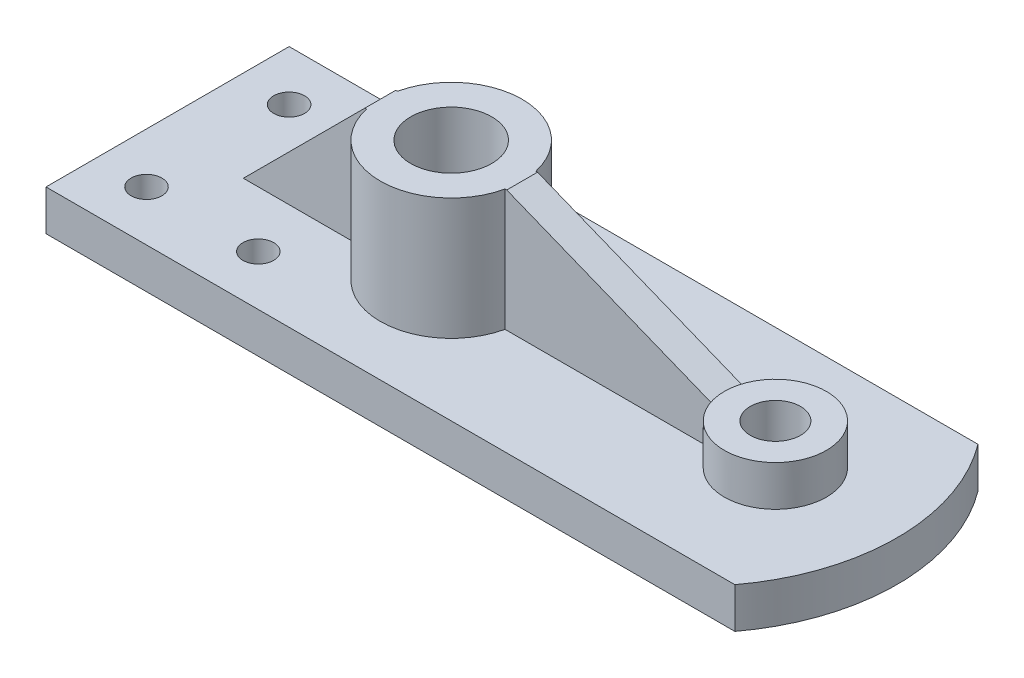
ISO-10303-21;
HEADER;
FILE_DESCRIPTION(('STEP AP214'),'2;1');
FILE_NAME('part.step','',(''),(''),'','','');
FILE_SCHEMA(('AUTOMOTIVE_DESIGN { 1 0 10303 214 1 1 1 1 }'));
ENDSEC;
DATA;
#1=APPLICATION_CONTEXT('core data for automotive mechanical design processes');
#2=APPLICATION_PROTOCOL_DEFINITION('international standard','automotive_design',2000,#1);
#3=PRODUCT_CONTEXT('',#1,'mechanical');
#4=PRODUCT('Part','Part','',(#3));
#5=PRODUCT_RELATED_PRODUCT_CATEGORY('part','',(#4));
#6=PRODUCT_DEFINITION_FORMATION('','',#4);
#7=PRODUCT_DEFINITION_CONTEXT('part definition',#1,'design');
#8=PRODUCT_DEFINITION('design','',#6,#7);
#9=PRODUCT_DEFINITION_SHAPE('','',#8);
#10=(LENGTH_UNIT() NAMED_UNIT(*) SI_UNIT(.MILLI.,.METRE.));
#11=(NAMED_UNIT(*) PLANE_ANGLE_UNIT() SI_UNIT($,.RADIAN.));
#12=(NAMED_UNIT(*) SI_UNIT($,.STERADIAN.) SOLID_ANGLE_UNIT());
#13=UNCERTAINTY_MEASURE_WITH_UNIT(LENGTH_MEASURE(1.E-05),#10,'distance_accuracy_value','');
#14=(GEOMETRIC_REPRESENTATION_CONTEXT(3) GLOBAL_UNCERTAINTY_ASSIGNED_CONTEXT((#13)) GLOBAL_UNIT_ASSIGNED_CONTEXT((#10,
#11,#12)) REPRESENTATION_CONTEXT('',''));
#15=CARTESIAN_POINT('',(0.,0.,0.));
#16=DIRECTION('',(0.,0.,1.));
#17=DIRECTION('',(1.,0.,0.));
#18=AXIS2_PLACEMENT_3D('',#15,#16,#17);
#19=CARTESIAN_POINT('',(88.9,25.4,0.));
#20=DIRECTION('',(0.,-1.,0.));
#21=DIRECTION('',(0.,0.,-1.));
#22=AXIS2_PLACEMENT_3D('',#19,#20,#21);
#23=CYLINDRICAL_SURFACE('',#22,22.225);
#24=DIRECTION('',(0.,-1.,0.));
#25=VECTOR('',#24,1.);
#26=CARTESIAN_POINT('',(110.594707856987,25.4,-4.826));
#27=LINE('',#26,#25);
#28=CARTESIAN_POINT('',(110.594707856987,12.7,-4.826));
#29=VERTEX_POINT('',#28);
#30=CARTESIAN_POINT('',(110.594707856987,50.8,-4.826));
#31=VERTEX_POINT('',#30);
#32=EDGE_CURVE('E180',#29,#31,#27,.F.);
#33=ORIENTED_EDGE('',*,*,#32,.F.);
#34=CARTESIAN_POINT('',(88.9,12.7,0.));
#35=DIRECTION('',(0.,1.,0.));
#36=DIRECTION('',(0.,0.,1.));
#37=AXIS2_PLACEMENT_3D('',#34,#35,#36);
#38=CIRCLE('',#37,22.225);
#39=CARTESIAN_POINT('',(67.2052921430133,12.7,-4.826));
#40=VERTEX_POINT('',#39);
#41=EDGE_CURVE('E230',#29,#40,#38,.T.);
#42=ORIENTED_EDGE('',*,*,#41,.T.);
#43=DIRECTION('',(0.,-1.,0.));
#44=VECTOR('',#43,1.);
#45=CARTESIAN_POINT('',(67.2052921430133,25.4,-4.826));
#46=LINE('',#45,#44);
#47=CARTESIAN_POINT('',(67.2052921430133,50.8,-4.826));
#48=VERTEX_POINT('',#47);
#49=EDGE_CURVE('E205',#48,#40,#46,.T.);
#50=ORIENTED_EDGE('',*,*,#49,.F.);
#51=CARTESIAN_POINT('',(88.9,50.8,0.));
#52=DIRECTION('',(0.,1.,0.));
#53=DIRECTION('',(0.,0.,1.));
#54=AXIS2_PLACEMENT_3D('',#51,#52,#53);
#55=CIRCLE('',#54,22.225);
#56=EDGE_CURVE('E221',#31,#48,#55,.T.);
#57=ORIENTED_EDGE('',*,*,#56,.F.);
#58=EDGE_LOOP('',(#33,#42,#50,#57));
#59=FACE_BOUND('',#58,.T.);
#60=ADVANCED_FACE('F55',(#59),#23,.T.);
#61=CARTESIAN_POINT('',(0.,12.7,0.));
#62=DIRECTION('',(0.,1.,0.));
#63=DIRECTION('',(0.,0.,1.));
#64=AXIS2_PLACEMENT_3D('',#61,#62,#63);
#65=PLANE('',#64);
#66=DIRECTION('',(1.,0.,0.));
#67=VECTOR('',#66,1.);
#68=CARTESIAN_POINT('',(0.,12.7,-4.826));
#69=LINE('',#68,#67);
#70=CARTESIAN_POINT('',(175.243076063636,12.7,-4.826));
#71=VERTEX_POINT('',#70);
#72=EDGE_CURVE('E177',#29,#71,#69,.T.);
#73=ORIENTED_EDGE('',*,*,#72,.T.);
#74=CARTESIAN_POINT('',(190.5,12.7,0.));
#75=DIRECTION('',(0.,1.,0.));
#76=DIRECTION('',(0.,0.,1.));
#77=AXIS2_PLACEMENT_3D('',#74,#75,#76);
#78=CIRCLE('',#77,16.002);
#79=CARTESIAN_POINT('',(175.243076063636,12.7,4.826));
#80=VERTEX_POINT('',#79);
#81=EDGE_CURVE('E226',#80,#71,#78,.T.);
#82=ORIENTED_EDGE('',*,*,#81,.F.);
#83=DIRECTION('',(1.,0.,0.));
#84=VECTOR('',#83,1.);
#85=CARTESIAN_POINT('',(0.,12.7,4.826));
#86=LINE('',#85,#84);
#87=CARTESIAN_POINT('',(110.594707856987,12.7,4.826));
#88=VERTEX_POINT('',#87);
#89=EDGE_CURVE('E184',#88,#80,#86,.T.);
#90=ORIENTED_EDGE('',*,*,#89,.F.);
#91=CARTESIAN_POINT('',(67.2052921430133,12.7,4.826));
#92=VERTEX_POINT('',#91);
#93=EDGE_CURVE('E232',#92,#88,#38,.T.);
#94=ORIENTED_EDGE('',*,*,#93,.F.);
#95=DIRECTION('',(1.,0.,0.));
#96=VECTOR('',#95,1.);
#97=CARTESIAN_POINT('',(0.,12.7,4.826));
#98=LINE('',#97,#96);
#99=CARTESIAN_POINT('',(28.5750000000002,12.7,4.826));
#100=VERTEX_POINT('',#99);
#101=EDGE_CURVE('E212',#100,#92,#98,.T.);
#102=ORIENTED_EDGE('',*,*,#101,.F.);
#103=DIRECTION('',(0.,0.,-1.));
#104=VECTOR('',#103,1.);
#105=CARTESIAN_POINT('',(28.5750000000002,12.7,0.));
#106=LINE('',#105,#104);
#107=CARTESIAN_POINT('',(28.5750000000002,12.7,-4.826));
#108=VERTEX_POINT('',#107);
#109=EDGE_CURVE('E215',#108,#100,#106,.F.);
#110=ORIENTED_EDGE('',*,*,#109,.F.);
#111=DIRECTION('',(1.,0.,0.));
#112=VECTOR('',#111,1.);
#113=CARTESIAN_POINT('',(0.,12.7,-4.826));
#114=LINE('',#113,#112);
#115=EDGE_CURVE('E206',#108,#40,#114,.T.);
#116=ORIENTED_EDGE('',*,*,#115,.T.);
#117=ORIENTED_EDGE('',*,*,#41,.F.);
#118=EDGE_LOOP('',(#73,#82,#90,#94,#102,#110,#116,#117));
#119=FACE_BOUND('',#118,.T.);
#120=DIRECTION('',(1.,0.,0.));
#121=VECTOR('',#120,1.);
#122=CARTESIAN_POINT('',(0.,12.7,-38.1));
#123=LINE('',#122,#121);
#124=CARTESIAN_POINT('',(0.,12.7,-38.1));
#125=VERTEX_POINT('',#124);
#126=CARTESIAN_POINT('',(215.9,12.7,-38.1));
#127=VERTEX_POINT('',#126);
#128=EDGE_CURVE('E245',#125,#127,#123,.T.);
#129=ORIENTED_EDGE('',*,*,#128,.F.);
#130=DIRECTION('',(0.,0.,-1.));
#131=VECTOR('',#130,1.);
#132=CARTESIAN_POINT('',(0.,12.7,0.));
#133=LINE('',#132,#131);
#134=CARTESIAN_POINT('',(0.,12.7,38.1));
#135=VERTEX_POINT('',#134);
#136=EDGE_CURVE('E248',#135,#125,#133,.T.);
#137=ORIENTED_EDGE('',*,*,#136,.F.);
#138=DIRECTION('',(1.,0.,0.));
#139=VECTOR('',#138,1.);
#140=CARTESIAN_POINT('',(0.,12.7,38.1));
#141=LINE('',#140,#139);
#142=CARTESIAN_POINT('',(215.9,12.7,38.1));
#143=VERTEX_POINT('',#142);
#144=EDGE_CURVE('E239',#135,#143,#141,.T.);
#145=ORIENTED_EDGE('',*,*,#144,.T.);
#146=CARTESIAN_POINT('',(165.1,12.7,0.));
#147=DIRECTION('',(0.,1.,0.));
#148=DIRECTION('',(0.,0.,1.));
#149=AXIS2_PLACEMENT_3D('',#146,#147,#148);
#150=CIRCLE('',#149,63.5);
#151=EDGE_CURVE('E243',#143,#127,#150,.T.);
#152=ORIENTED_EDGE('',*,*,#151,.T.);
#153=EDGE_LOOP('',(#129,#137,#145,#152));
#154=FACE_BOUND('',#153,.T.);
#155=CARTESIAN_POINT('',(50.8,12.7,22.352));
#156=DIRECTION('',(0.,1.,0.));
#157=DIRECTION('',(0.,0.,1.));
#158=AXIS2_PLACEMENT_3D('',#155,#156,#157);
#159=CIRCLE('',#158,4.826);
#160=CARTESIAN_POINT('',(50.8,12.7,27.178));
#161=VERTEX_POINT('',#160);
#162=EDGE_CURVE('E236',#161,#161,#159,.T.);
#163=ORIENTED_EDGE('',*,*,#162,.F.);
#164=EDGE_LOOP('',(#163));
#165=FACE_BOUND('',#164,.T.);
#166=CARTESIAN_POINT('',(15.748,12.7,-22.352));
#167=DIRECTION('',(0.,1.,0.));
#168=DIRECTION('',(0.,0.,1.));
#169=AXIS2_PLACEMENT_3D('',#166,#167,#168);
#170=CIRCLE('',#169,4.826);
#171=CARTESIAN_POINT('',(15.748,12.7,-17.526));
#172=VERTEX_POINT('',#171);
#173=EDGE_CURVE('E250',#172,#172,#170,.T.);
#174=ORIENTED_EDGE('',*,*,#173,.F.);
#175=EDGE_LOOP('',(#174));
#176=FACE_BOUND('',#175,.T.);
#177=CARTESIAN_POINT('',(15.748,12.7,22.352));
#178=DIRECTION('',(0.,1.,0.));
#179=DIRECTION('',(0.,0.,1.));
#180=AXIS2_PLACEMENT_3D('',#177,#178,#179);
#181=CIRCLE('',#180,4.826);
#182=CARTESIAN_POINT('',(15.748,12.7,27.178));
#183=VERTEX_POINT('',#182);
#184=EDGE_CURVE('E253',#183,#183,#181,.F.);
#185=ORIENTED_EDGE('',*,*,#184,.T.);
#186=EDGE_LOOP('',(#185));
#187=FACE_BOUND('',#186,.T.);
#188=ADVANCED_FACE('F300',(#119,#154,#165,#176,#187),#65,.T.);
#189=CARTESIAN_POINT('',(0.,12.7,38.1));
#190=DIRECTION('',(0.,0.,-1.));
#191=DIRECTION('',(-1.,0.,0.));
#192=AXIS2_PLACEMENT_3D('',#189,#190,#191);
#193=PLANE('',#192);
#194=DIRECTION('',(1.,0.,0.));
#195=VECTOR('',#194,1.);
#196=CARTESIAN_POINT('',(0.,0.,38.1));
#197=LINE('',#196,#195);
#198=CARTESIAN_POINT('',(0.,0.,38.1));
#199=VERTEX_POINT('',#198);
#200=CARTESIAN_POINT('',(215.9,0.,38.1));
#201=VERTEX_POINT('',#200);
#202=EDGE_CURVE('E262',#199,#201,#197,.T.);
#203=ORIENTED_EDGE('',*,*,#202,.T.);
#204=DIRECTION('',(0.,-1.,0.));
#205=VECTOR('',#204,1.);
#206=CARTESIAN_POINT('',(215.9,12.7,38.1));
#207=LINE('',#206,#205);
#208=EDGE_CURVE('E12',#143,#201,#207,.T.);
#209=ORIENTED_EDGE('',*,*,#208,.F.);
#210=ORIENTED_EDGE('',*,*,#144,.F.);
#211=DIRECTION('',(0.,-1.,0.));
#212=VECTOR('',#211,1.);
#213=CARTESIAN_POINT('',(0.,12.7,38.1));
#214=LINE('',#213,#212);
#215=EDGE_CURVE('E256',#135,#199,#214,.T.);
#216=ORIENTED_EDGE('',*,*,#215,.T.);
#217=EDGE_LOOP('',(#203,#209,#210,#216));
#218=FACE_BOUND('',#217,.T.);
#219=ADVANCED_FACE('F306',(#218),#193,.F.);
#220=CARTESIAN_POINT('',(165.1,12.7,0.));
#221=DIRECTION('',(0.,-1.,0.));
#222=DIRECTION('',(0.,0.,-1.));
#223=AXIS2_PLACEMENT_3D('',#220,#221,#222);
#224=CYLINDRICAL_SURFACE('',#223,63.5);
#225=CARTESIAN_POINT('',(165.1,0.,0.));
#226=DIRECTION('',(0.,1.,0.));
#227=DIRECTION('',(0.,0.,1.));
#228=AXIS2_PLACEMENT_3D('',#225,#226,#227);
#229=CIRCLE('',#228,63.5);
#230=CARTESIAN_POINT('',(215.9,0.,-38.1));
#231=VERTEX_POINT('',#230);
#232=EDGE_CURVE('E265',#201,#231,#229,.T.);
#233=ORIENTED_EDGE('',*,*,#232,.T.);
#234=DIRECTION('',(0.,-1.,0.));
#235=VECTOR('',#234,1.);
#236=CARTESIAN_POINT('',(215.9,12.7,-38.1));
#237=LINE('',#236,#235);
#238=EDGE_CURVE('E63',#127,#231,#237,.T.);
#239=ORIENTED_EDGE('',*,*,#238,.F.);
#240=ORIENTED_EDGE('',*,*,#151,.F.);
#241=ORIENTED_EDGE('',*,*,#208,.T.);
#242=EDGE_LOOP('',(#233,#239,#240,#241));
#243=FACE_BOUND('',#242,.T.);
#244=ADVANCED_FACE('F304',(#243),#224,.T.);
#245=CARTESIAN_POINT('',(0.,12.7,-38.1));
#246=DIRECTION('',(0.,0.,-1.));
#247=DIRECTION('',(-1.,0.,0.));
#248=AXIS2_PLACEMENT_3D('',#245,#246,#247);
#249=PLANE('',#248);
#250=DIRECTION('',(1.,0.,0.));
#251=VECTOR('',#250,1.);
#252=CARTESIAN_POINT('',(0.,0.,-38.1));
#253=LINE('',#252,#251);
#254=CARTESIAN_POINT('',(0.,0.,-38.1));
#255=VERTEX_POINT('',#254);
#256=EDGE_CURVE('E267',#255,#231,#253,.T.);
#257=ORIENTED_EDGE('',*,*,#256,.F.);
#258=DIRECTION('',(0.,-1.,0.));
#259=VECTOR('',#258,1.);
#260=CARTESIAN_POINT('',(0.,12.7,-38.1));
#261=LINE('',#260,#259);
#262=EDGE_CURVE('E281',#125,#255,#261,.T.);
#263=ORIENTED_EDGE('',*,*,#262,.F.);
#264=ORIENTED_EDGE('',*,*,#128,.T.);
#265=ORIENTED_EDGE('',*,*,#238,.T.);
#266=EDGE_LOOP('',(#257,#263,#264,#265));
#267=FACE_BOUND('',#266,.T.);
#268=ADVANCED_FACE('F287',(#267),#249,.T.);
#269=CARTESIAN_POINT('',(15.748,12.7,22.352));
#270=DIRECTION('',(0.,-1.,0.));
#271=DIRECTION('',(0.,0.,-1.));
#272=AXIS2_PLACEMENT_3D('',#269,#270,#271);
#273=CYLINDRICAL_SURFACE('',#272,4.826);
#274=ORIENTED_EDGE('',*,*,#184,.F.);
#275=EDGE_LOOP('',(#274));
#276=FACE_BOUND('',#275,.T.);
#277=CARTESIAN_POINT('',(15.748,0.,22.352));
#278=DIRECTION('',(0.,1.,0.));
#279=DIRECTION('',(0.,0.,1.));
#280=AXIS2_PLACEMENT_3D('',#277,#278,#279);
#281=CIRCLE('',#280,4.826);
#282=CARTESIAN_POINT('',(15.748,0.,27.178));
#283=VERTEX_POINT('',#282);
#284=EDGE_CURVE('E275',#283,#283,#281,.F.);
#285=ORIENTED_EDGE('',*,*,#284,.T.);
#286=EDGE_LOOP('',(#285));
#287=FACE_BOUND('',#286,.T.);
#288=ADVANCED_FACE('F541',(#276,#287),#273,.F.);
#289=CARTESIAN_POINT('',(15.748,12.7,-22.352));
#290=DIRECTION('',(0.,-1.,0.));
#291=DIRECTION('',(0.,0.,-1.));
#292=AXIS2_PLACEMENT_3D('',#289,#290,#291);
#293=CYLINDRICAL_SURFACE('',#292,4.826);
#294=ORIENTED_EDGE('',*,*,#173,.T.);
#295=EDGE_LOOP('',(#294));
#296=FACE_BOUND('',#295,.T.);
#297=CARTESIAN_POINT('',(15.748,0.,-22.352));
#298=DIRECTION('',(0.,1.,0.));
#299=DIRECTION('',(0.,0.,1.));
#300=AXIS2_PLACEMENT_3D('',#297,#298,#299);
#301=CIRCLE('',#300,4.826);
#302=CARTESIAN_POINT('',(15.748,0.,-17.526));
#303=VERTEX_POINT('',#302);
#304=EDGE_CURVE('E272',#303,#303,#301,.T.);
#305=ORIENTED_EDGE('',*,*,#304,.F.);
#306=EDGE_LOOP('',(#305));
#307=FACE_BOUND('',#306,.T.);
#308=ADVANCED_FACE('F440',(#296,#307),#293,.F.);
#309=CARTESIAN_POINT('',(0.,12.7,0.));
#310=DIRECTION('',(-1.,0.,0.));
#311=DIRECTION('',(0.,0.,1.));
#312=AXIS2_PLACEMENT_3D('',#309,#310,#311);
#313=PLANE('',#312);
#314=ORIENTED_EDGE('',*,*,#136,.T.);
#315=ORIENTED_EDGE('',*,*,#262,.T.);
#316=DIRECTION('',(0.,0.,-1.));
#317=VECTOR('',#316,1.);
#318=CARTESIAN_POINT('',(0.,0.,0.));
#319=LINE('',#318,#317);
#320=EDGE_CURVE('E270',#199,#255,#319,.T.);
#321=ORIENTED_EDGE('',*,*,#320,.F.);
#322=ORIENTED_EDGE('',*,*,#215,.F.);
#323=EDGE_LOOP('',(#314,#315,#321,#322));
#324=FACE_BOUND('',#323,.T.);
#325=ADVANCED_FACE('F297',(#324),#313,.T.);
#326=CARTESIAN_POINT('',(50.8,12.7,22.352));
#327=DIRECTION('',(0.,-1.,0.));
#328=DIRECTION('',(0.,0.,-1.));
#329=AXIS2_PLACEMENT_3D('',#326,#327,#328);
#330=CYLINDRICAL_SURFACE('',#329,4.826);
#331=ORIENTED_EDGE('',*,*,#162,.T.);
#332=EDGE_LOOP('',(#331));
#333=FACE_BOUND('',#332,.T.);
#334=CARTESIAN_POINT('',(50.8,0.,22.352));
#335=DIRECTION('',(0.,1.,0.));
#336=DIRECTION('',(0.,0.,1.));
#337=AXIS2_PLACEMENT_3D('',#334,#335,#336);
#338=CIRCLE('',#337,4.826);
#339=CARTESIAN_POINT('',(50.8,0.,27.178));
#340=VERTEX_POINT('',#339);
#341=EDGE_CURVE('E259',#340,#340,#338,.T.);
#342=ORIENTED_EDGE('',*,*,#341,.F.);
#343=EDGE_LOOP('',(#342));
#344=FACE_BOUND('',#343,.T.);
#345=ADVANCED_FACE('F439',(#333,#344),#330,.F.);
#346=CARTESIAN_POINT('',(88.9,12.7,0.));
#347=DIRECTION('',(0.,-1.,0.));
#348=DIRECTION('',(0.,0.,-1.));
#349=AXIS2_PLACEMENT_3D('',#346,#347,#348);
#350=CYLINDRICAL_SURFACE('',#349,12.7);
#351=CARTESIAN_POINT('',(88.9,0.,0.));
#352=DIRECTION('',(0.,1.,0.));
#353=DIRECTION('',(0.,0.,1.));
#354=AXIS2_PLACEMENT_3D('',#351,#352,#353);
#355=CIRCLE('',#354,12.7);
#356=CARTESIAN_POINT('',(88.9,0.,12.7));
#357=VERTEX_POINT('',#356);
#358=EDGE_CURVE('E235',#357,#357,#355,.T.);
#359=ORIENTED_EDGE('',*,*,#358,.F.);
#360=EDGE_LOOP('',(#359));
#361=FACE_BOUND('',#360,.T.);
#362=CARTESIAN_POINT('',(88.9,50.8,0.));
#363=DIRECTION('',(0.,1.,0.));
#364=DIRECTION('',(0.,0.,1.));
#365=AXIS2_PLACEMENT_3D('',#362,#363,#364);
#366=CIRCLE('',#365,12.7);
#367=CARTESIAN_POINT('',(88.9,50.8,12.7));
#368=VERTEX_POINT('',#367);
#369=EDGE_CURVE('E218',#368,#368,#366,.T.);
#370=ORIENTED_EDGE('',*,*,#369,.T.);
#371=EDGE_LOOP('',(#370));
#372=FACE_BOUND('',#371,.T.);
#373=ADVANCED_FACE('F57',(#361,#372),#350,.F.);
#374=CARTESIAN_POINT('',(190.5,12.7,0.));
#375=DIRECTION('',(0.,-1.,0.));
#376=DIRECTION('',(0.,0.,-1.));
#377=AXIS2_PLACEMENT_3D('',#374,#375,#376);
#378=CYLINDRICAL_SURFACE('',#377,7.874);
#379=CARTESIAN_POINT('',(190.5,0.,0.));
#380=DIRECTION('',(0.,1.,0.));
#381=DIRECTION('',(0.,0.,1.));
#382=AXIS2_PLACEMENT_3D('',#379,#380,#381);
#383=CIRCLE('',#382,7.874);
#384=CARTESIAN_POINT('',(190.5,0.,7.874));
#385=VERTEX_POINT('',#384);
#386=EDGE_CURVE('E240',#385,#385,#383,.T.);
#387=ORIENTED_EDGE('',*,*,#386,.F.);
#388=EDGE_LOOP('',(#387));
#389=FACE_BOUND('',#388,.T.);
#390=CARTESIAN_POINT('',(190.5,25.4,0.));
#391=DIRECTION('',(0.,1.,0.));
#392=DIRECTION('',(0.,0.,1.));
#393=AXIS2_PLACEMENT_3D('',#390,#391,#392);
#394=CIRCLE('',#393,7.874);
#395=CARTESIAN_POINT('',(190.5,25.4,7.874));
#396=VERTEX_POINT('',#395);
#397=EDGE_CURVE('E223',#396,#396,#394,.T.);
#398=ORIENTED_EDGE('',*,*,#397,.T.);
#399=EDGE_LOOP('',(#398));
#400=FACE_BOUND('',#399,.T.);
#401=ADVANCED_FACE('F333',(#389,#400),#378,.F.);
#402=CARTESIAN_POINT('',(0.,0.,0.));
#403=DIRECTION('',(0.,1.,0.));
#404=DIRECTION('',(0.,0.,1.));
#405=AXIS2_PLACEMENT_3D('',#402,#403,#404);
#406=PLANE('',#405);
#407=ORIENTED_EDGE('',*,*,#358,.T.);
#408=EDGE_LOOP('',(#407));
#409=FACE_BOUND('',#408,.T.);
#410=ORIENTED_EDGE('',*,*,#386,.T.);
#411=EDGE_LOOP('',(#410));
#412=FACE_BOUND('',#411,.T.);
#413=ORIENTED_EDGE('',*,*,#320,.T.);
#414=ORIENTED_EDGE('',*,*,#256,.T.);
#415=ORIENTED_EDGE('',*,*,#232,.F.);
#416=ORIENTED_EDGE('',*,*,#202,.F.);
#417=EDGE_LOOP('',(#413,#414,#415,#416));
#418=FACE_BOUND('',#417,.T.);
#419=ORIENTED_EDGE('',*,*,#341,.T.);
#420=EDGE_LOOP('',(#419));
#421=FACE_BOUND('',#420,.T.);
#422=ORIENTED_EDGE('',*,*,#284,.F.);
#423=EDGE_LOOP('',(#422));
#424=FACE_BOUND('',#423,.T.);
#425=ORIENTED_EDGE('',*,*,#304,.T.);
#426=EDGE_LOOP('',(#425));
#427=FACE_BOUND('',#426,.T.);
#428=ADVANCED_FACE('F292',(#409,#412,#418,#421,#424,#427),#406,.F.);
#429=ORIENTED_EDGE('',*,*,#93,.T.);
#430=DIRECTION('',(0.,-1.,0.));
#431=VECTOR('',#430,1.);
#432=CARTESIAN_POINT('',(110.594707856987,25.4,4.826));
#433=LINE('',#432,#431);
#434=CARTESIAN_POINT('',(110.594707856987,50.8,4.826));
#435=VERTEX_POINT('',#434);
#436=EDGE_CURVE('E186',#88,#435,#433,.F.);
#437=ORIENTED_EDGE('',*,*,#436,.T.);
#438=CARTESIAN_POINT('',(67.2052921430133,50.8,4.826));
#439=VERTEX_POINT('',#438);
#440=EDGE_CURVE('E78',#439,#435,#55,.T.);
#441=ORIENTED_EDGE('',*,*,#440,.F.);
#442=DIRECTION('',(0.,-1.,0.));
#443=VECTOR('',#442,1.);
#444=CARTESIAN_POINT('',(67.2052921430133,25.4,4.826));
#445=LINE('',#444,#443);
#446=EDGE_CURVE('E209',#439,#92,#445,.T.);
#447=ORIENTED_EDGE('',*,*,#446,.T.);
#448=EDGE_LOOP('',(#429,#437,#441,#447));
#449=FACE_BOUND('',#448,.T.);
#450=ADVANCED_FACE('F319',(#449),#23,.T.);
#451=CARTESIAN_POINT('',(190.5,25.4,0.));
#452=DIRECTION('',(0.,1.,0.));
#453=DIRECTION('',(0.,0.,1.));
#454=AXIS2_PLACEMENT_3D('',#451,#452,#453);
#455=PLANE('',#454);
#456=ORIENTED_EDGE('',*,*,#397,.F.);
#457=EDGE_LOOP('',(#456));
#458=FACE_BOUND('',#457,.T.);
#459=CARTESIAN_POINT('',(190.5,25.4,0.));
#460=DIRECTION('',(0.,1.,0.));
#461=DIRECTION('',(0.,0.,1.));
#462=AXIS2_PLACEMENT_3D('',#459,#460,#461);
#463=CIRCLE('',#462,16.002);
#464=CARTESIAN_POINT('',(174.498,25.4,0.));
#465=VERTEX_POINT('',#464);
#466=EDGE_CURVE('E227',#465,#465,#463,.T.);
#467=ORIENTED_EDGE('',*,*,#466,.T.);
#468=EDGE_LOOP('',(#467));
#469=FACE_BOUND('',#468,.T.);
#470=ADVANCED_FACE('F325',(#458,#469),#455,.T.);
#471=CARTESIAN_POINT('',(190.5,25.4,0.));
#472=DIRECTION('',(0.,-1.,0.));
#473=DIRECTION('',(0.,0.,-1.));
#474=AXIS2_PLACEMENT_3D('',#471,#472,#473);
#475=CYLINDRICAL_SURFACE('',#474,16.002);
#476=ORIENTED_EDGE('',*,*,#81,.T.);
#477=DIRECTION('',(0.,-1.,0.));
#478=VECTOR('',#477,1.);
#479=CARTESIAN_POINT('',(175.243076063636,25.4,-4.826));
#480=LINE('',#479,#478);
#481=CARTESIAN_POINT('',(175.243076063636,25.101372319184,-4.826));
#482=VERTEX_POINT('',#481);
#483=EDGE_CURVE('E163',#482,#71,#480,.T.);
#484=ORIENTED_EDGE('',*,*,#483,.F.);
#485=CARTESIAN_POINT('',(190.5,18.986372745491,0.));
#486=DIRECTION('',(-0.372032022248701,-0.92821989551051,0.));
#487=DIRECTION('',(0.92821989551051,-0.372032022248701,0.));
#488=AXIS2_PLACEMENT_3D('',#485,#486,#487);
#489=ELLIPSE('',#488,17.2394494854035,16.002);
#490=EDGE_CURVE('E190',#482,#465,#489,.F.);
#491=ORIENTED_EDGE('',*,*,#490,.T.);
#492=ORIENTED_EDGE('',*,*,#466,.F.);
#493=CARTESIAN_POINT('',(175.243076063636,25.101372319184,4.826));
#494=VERTEX_POINT('',#493);
#495=EDGE_CURVE('E189',#465,#494,#489,.F.);
#496=ORIENTED_EDGE('',*,*,#495,.T.);
#497=DIRECTION('',(0.,-1.,0.));
#498=VECTOR('',#497,1.);
#499=CARTESIAN_POINT('',(175.243076063636,25.4,4.826));
#500=LINE('',#499,#498);
#501=EDGE_CURVE('E172',#494,#80,#500,.T.);
#502=ORIENTED_EDGE('',*,*,#501,.T.);
#503=EDGE_LOOP('',(#476,#484,#491,#492,#496,#502));
#504=FACE_BOUND('',#503,.T.);
#505=ADVANCED_FACE('F330',(#504),#475,.T.);
#506=CARTESIAN_POINT('',(88.9,50.8,0.));
#507=DIRECTION('',(0.,1.,0.));
#508=DIRECTION('',(0.,0.,1.));
#509=AXIS2_PLACEMENT_3D('',#506,#507,#508);
#510=PLANE('',#509);
#511=ORIENTED_EDGE('',*,*,#369,.F.);
#512=EDGE_LOOP('',(#511));
#513=FACE_BOUND('',#512,.T.);
#514=DIRECTION('',(1.,0.,0.));
#515=VECTOR('',#514,1.);
#516=CARTESIAN_POINT('',(114.3,50.8,4.826));
#517=LINE('',#516,#515);
#518=CARTESIAN_POINT('',(66.675,50.8,4.826));
#519=VERTEX_POINT('',#518);
#520=EDGE_CURVE('E198',#519,#439,#517,.T.);
#521=ORIENTED_EDGE('',*,*,#520,.T.);
#522=ORIENTED_EDGE('',*,*,#440,.T.);
#523=DIRECTION('',(1.,0.,0.));
#524=VECTOR('',#523,1.);
#525=CARTESIAN_POINT('',(114.3,50.8,4.826));
#526=LINE('',#525,#524);
#527=CARTESIAN_POINT('',(111.125,50.8,4.826));
#528=VERTEX_POINT('',#527);
#529=EDGE_CURVE('E165',#435,#528,#526,.T.);
#530=ORIENTED_EDGE('',*,*,#529,.T.);
#531=DIRECTION('',(0.,0.,1.));
#532=VECTOR('',#531,1.);
#533=CARTESIAN_POINT('',(111.125,50.8,0.));
#534=LINE('',#533,#532);
#535=CARTESIAN_POINT('',(111.125,50.8,-4.826));
#536=VERTEX_POINT('',#535);
#537=EDGE_CURVE('E155',#536,#528,#534,.T.);
#538=ORIENTED_EDGE('',*,*,#537,.F.);
#539=DIRECTION('',(1.,0.,0.));
#540=VECTOR('',#539,1.);
#541=CARTESIAN_POINT('',(114.3,50.8,-4.826));
#542=LINE('',#541,#540);
#543=EDGE_CURVE('E70',#31,#536,#542,.T.);
#544=ORIENTED_EDGE('',*,*,#543,.F.);
#545=ORIENTED_EDGE('',*,*,#56,.T.);
#546=DIRECTION('',(1.,0.,0.));
#547=VECTOR('',#546,1.);
#548=CARTESIAN_POINT('',(114.3,50.8,-4.826));
#549=LINE('',#548,#547);
#550=CARTESIAN_POINT('',(66.675,50.8,-4.826));
#551=VERTEX_POINT('',#550);
#552=EDGE_CURVE('E193',#551,#48,#549,.T.);
#553=ORIENTED_EDGE('',*,*,#552,.F.);
#554=DIRECTION('',(0.,0.,1.));
#555=VECTOR('',#554,1.);
#556=CARTESIAN_POINT('',(66.675,50.8,0.));
#557=LINE('',#556,#555);
#558=EDGE_CURVE('E197',#551,#519,#557,.T.);
#559=ORIENTED_EDGE('',*,*,#558,.T.);
#560=EDGE_LOOP('',(#521,#522,#530,#538,#544,#545,#553,#559));
#561=FACE_BOUND('',#560,.T.);
#562=ADVANCED_FACE('F166',(#513,#561),#510,.T.);
#563=CARTESIAN_POINT('',(114.3,25.4,4.826));
#564=DIRECTION('',(0.,0.,1.));
#565=DIRECTION('',(1.,0.,0.));
#566=AXIS2_PLACEMENT_3D('',#563,#564,#565);
#567=PLANE('',#566);
#568=DIRECTION('',(0.707106781186546,0.707106781186549,0.));
#569=VECTOR('',#568,1.);
#570=CARTESIAN_POINT('',(28.5750000000002,12.7,4.826));
#571=LINE('',#570,#569);
#572=EDGE_CURVE('E194',#100,#519,#571,.T.);
#573=ORIENTED_EDGE('',*,*,#572,.F.);
#574=ORIENTED_EDGE('',*,*,#101,.T.);
#575=ORIENTED_EDGE('',*,*,#446,.F.);
#576=ORIENTED_EDGE('',*,*,#520,.F.);
#577=EDGE_LOOP('',(#573,#574,#575,#576));
#578=FACE_BOUND('',#577,.T.);
#579=ADVANCED_FACE('F342',(#578),#567,.T.);
#580=CARTESIAN_POINT('',(114.3,25.4,-4.826));
#581=DIRECTION('',(0.,0.,1.));
#582=DIRECTION('',(1.,0.,0.));
#583=AXIS2_PLACEMENT_3D('',#580,#581,#582);
#584=PLANE('',#583);
#585=ORIENTED_EDGE('',*,*,#115,.F.);
#586=DIRECTION('',(0.707106781186546,0.707106781186549,0.));
#587=VECTOR('',#586,1.);
#588=CARTESIAN_POINT('',(28.5750000000002,12.7,-4.826));
#589=LINE('',#588,#587);
#590=EDGE_CURVE('E200',#108,#551,#589,.T.);
#591=ORIENTED_EDGE('',*,*,#590,.T.);
#592=ORIENTED_EDGE('',*,*,#552,.T.);
#593=ORIENTED_EDGE('',*,*,#49,.T.);
#594=EDGE_LOOP('',(#585,#591,#592,#593));
#595=FACE_BOUND('',#594,.T.);
#596=ADVANCED_FACE('F351',(#595),#584,.F.);
#597=CARTESIAN_POINT('',(28.5750000000002,12.7,0.));
#598=DIRECTION('',(0.707106781186549,-0.707106781186546,0.));
#599=DIRECTION('',(0.707106781186546,0.707106781186549,0.));
#600=AXIS2_PLACEMENT_3D('',#597,#598,#599);
#601=PLANE('',#600);
#602=ORIENTED_EDGE('',*,*,#590,.F.);
#603=ORIENTED_EDGE('',*,*,#109,.T.);
#604=ORIENTED_EDGE('',*,*,#572,.T.);
#605=ORIENTED_EDGE('',*,*,#558,.F.);
#606=EDGE_LOOP('',(#602,#603,#604,#605));
#607=FACE_BOUND('',#606,.T.);
#608=ADVANCED_FACE('F347',(#607),#601,.F.);
#609=CARTESIAN_POINT('',(111.125,50.8,0.));
#610=DIRECTION('',(-0.372032022248701,-0.92821989551051,0.));
#611=DIRECTION('',(0.92821989551051,-0.372032022248701,0.));
#612=AXIS2_PLACEMENT_3D('',#609,#610,#611);
#613=PLANE('',#612);
#614=ORIENTED_EDGE('',*,*,#490,.F.);
#615=DIRECTION('',(0.92821989551051,-0.372032022248701,0.));
#616=VECTOR('',#615,1.);
#617=CARTESIAN_POINT('',(111.125,50.8,-4.826));
#618=LINE('',#617,#616);
#619=EDGE_CURVE('E162',#536,#482,#618,.T.);
#620=ORIENTED_EDGE('',*,*,#619,.F.);
#621=ORIENTED_EDGE('',*,*,#537,.T.);
#622=DIRECTION('',(0.92821989551051,-0.372032022248701,0.));
#623=VECTOR('',#622,1.);
#624=CARTESIAN_POINT('',(111.125,50.8,4.826));
#625=LINE('',#624,#623);
#626=EDGE_CURVE('E159',#528,#494,#625,.T.);
#627=ORIENTED_EDGE('',*,*,#626,.T.);
#628=ORIENTED_EDGE('',*,*,#495,.F.);
#629=EDGE_LOOP('',(#614,#620,#621,#627,#628));
#630=FACE_BOUND('',#629,.T.);
#631=ADVANCED_FACE('F157',(#630),#613,.F.);
#632=CARTESIAN_POINT('',(114.3,25.4,4.826));
#633=DIRECTION('',(0.,0.,1.));
#634=DIRECTION('',(1.,0.,0.));
#635=AXIS2_PLACEMENT_3D('',#632,#633,#634);
#636=PLANE('',#635);
#637=ORIENTED_EDGE('',*,*,#436,.F.);
#638=ORIENTED_EDGE('',*,*,#89,.T.);
#639=ORIENTED_EDGE('',*,*,#501,.F.);
#640=ORIENTED_EDGE('',*,*,#626,.F.);
#641=ORIENTED_EDGE('',*,*,#529,.F.);
#642=EDGE_LOOP('',(#637,#638,#639,#640,#641));
#643=FACE_BOUND('',#642,.T.);
#644=ADVANCED_FACE('F169',(#643),#636,.T.);
#645=CARTESIAN_POINT('',(114.3,25.4,-4.826));
#646=DIRECTION('',(0.,0.,1.));
#647=DIRECTION('',(1.,0.,0.));
#648=AXIS2_PLACEMENT_3D('',#645,#646,#647);
#649=PLANE('',#648);
#650=ORIENTED_EDGE('',*,*,#72,.F.);
#651=ORIENTED_EDGE('',*,*,#32,.T.);
#652=ORIENTED_EDGE('',*,*,#543,.T.);
#653=ORIENTED_EDGE('',*,*,#619,.T.);
#654=ORIENTED_EDGE('',*,*,#483,.T.);
#655=EDGE_LOOP('',(#650,#651,#652,#653,#654));
#656=FACE_BOUND('',#655,.T.);
#657=ADVANCED_FACE('F355',(#656),#649,.F.);
#658=CLOSED_SHELL('',(#60,#188,#219,#244,#268,#288,#308,#325,#345,#373,#401,#428,#450,#470,#505,
#562,#579,#596,#608,#631,#644,#657));
#659=MANIFOLD_SOLID_BREP('B2',#658);
#660=ADVANCED_BREP_SHAPE_REPRESENTATION('',(#18,#659),#14);
#661=SHAPE_DEFINITION_REPRESENTATION(#9,#660);
ENDSEC;
END-ISO-10303-21;
